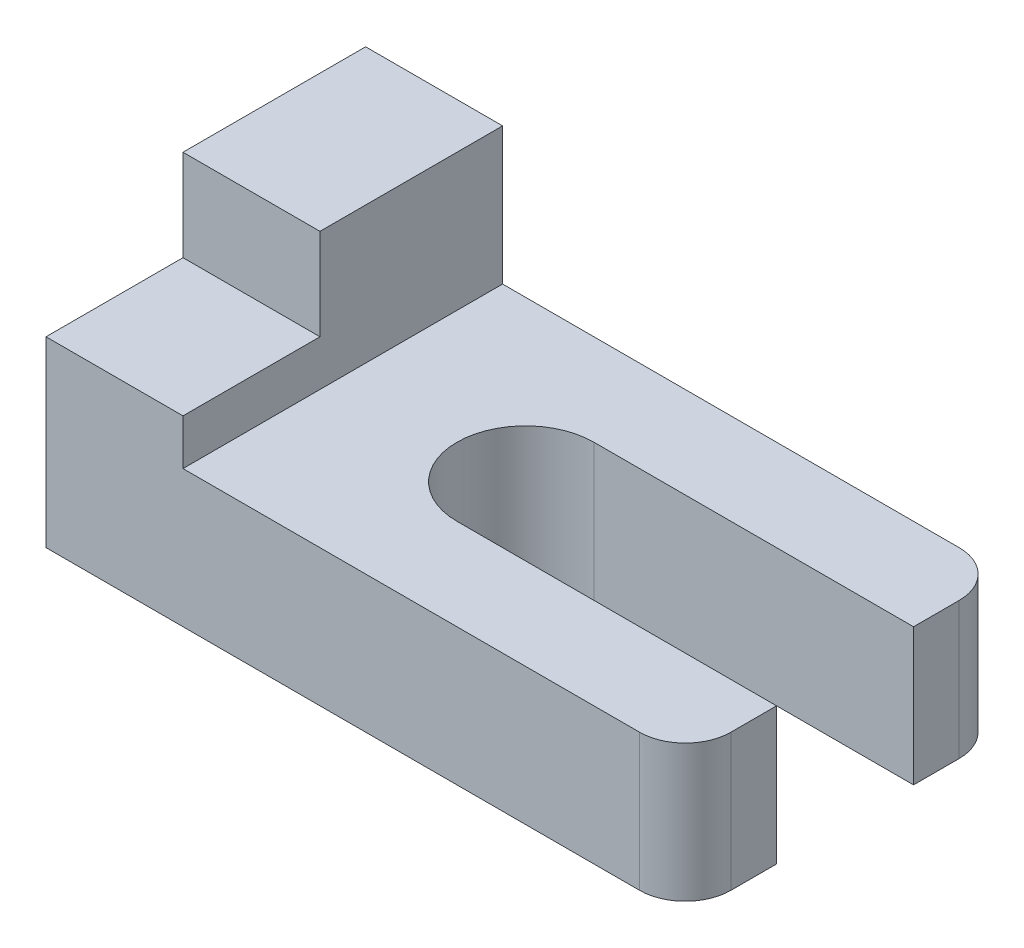
ISO-10303-21;
HEADER;
FILE_DESCRIPTION(('STEP AP214'),'2;1');
FILE_NAME('part.step','',(''),(''),'','','');
FILE_SCHEMA(('AUTOMOTIVE_DESIGN { 1 0 10303 214 1 1 1 1 }'));
ENDSEC;
DATA;
#1=APPLICATION_CONTEXT('core data for automotive mechanical design processes');
#2=APPLICATION_PROTOCOL_DEFINITION('international standard','automotive_design',2000,#1);
#3=PRODUCT_CONTEXT('',#1,'mechanical');
#4=PRODUCT('Part','Part','',(#3));
#5=PRODUCT_RELATED_PRODUCT_CATEGORY('part','',(#4));
#6=PRODUCT_DEFINITION_FORMATION('','',#4);
#7=PRODUCT_DEFINITION_CONTEXT('part definition',#1,'design');
#8=PRODUCT_DEFINITION('design','',#6,#7);
#9=PRODUCT_DEFINITION_SHAPE('','',#8);
#10=(LENGTH_UNIT() NAMED_UNIT(*) SI_UNIT(.MILLI.,.METRE.));
#11=(NAMED_UNIT(*) PLANE_ANGLE_UNIT() SI_UNIT($,.RADIAN.));
#12=(NAMED_UNIT(*) SI_UNIT($,.STERADIAN.) SOLID_ANGLE_UNIT());
#13=UNCERTAINTY_MEASURE_WITH_UNIT(LENGTH_MEASURE(1.E-05),#10,'distance_accuracy_value','');
#14=(GEOMETRIC_REPRESENTATION_CONTEXT(3) GLOBAL_UNCERTAINTY_ASSIGNED_CONTEXT((#13)) GLOBAL_UNIT_ASSIGNED_CONTEXT((#10,
#11,#12)) REPRESENTATION_CONTEXT('',''));
#15=CARTESIAN_POINT('',(0.,0.,0.));
#16=DIRECTION('',(0.,0.,1.));
#17=DIRECTION('',(1.,0.,0.));
#18=AXIS2_PLACEMENT_3D('',#15,#16,#17);
#19=CARTESIAN_POINT('',(70.,30.,0.));
#20=DIRECTION('',(-1.,0.,0.));
#21=DIRECTION('',(0.,0.,1.));
#22=AXIS2_PLACEMENT_3D('',#19,#20,#21);
#23=PLANE('',#22);
#24=DIRECTION('',(0.,0.,-1.));
#25=VECTOR('',#24,1.);
#26=CARTESIAN_POINT('',(70.,0.,0.));
#27=LINE('',#26,#25);
#28=CARTESIAN_POINT('',(70.,0.,-5.));
#29=VERTEX_POINT('',#28);
#30=CARTESIAN_POINT('',(70.,0.,-10.));
#31=VERTEX_POINT('',#30);
#32=EDGE_CURVE('E248',#29,#31,#27,.T.);
#33=ORIENTED_EDGE('',*,*,#32,.T.);
#34=DIRECTION('',(0.,1.,0.));
#35=VECTOR('',#34,1.);
#36=CARTESIAN_POINT('',(70.,0.,-10.));
#37=LINE('',#36,#35);
#38=CARTESIAN_POINT('',(70.,15.,-10.));
#39=VERTEX_POINT('',#38);
#40=EDGE_CURVE('E182',#31,#39,#37,.T.);
#41=ORIENTED_EDGE('',*,*,#40,.T.);
#42=DIRECTION('',(0.,0.,-1.));
#43=VECTOR('',#42,1.);
#44=CARTESIAN_POINT('',(70.,15.,-35.));
#45=LINE('',#44,#43);
#46=CARTESIAN_POINT('',(70.,15.,-5.));
#47=VERTEX_POINT('',#46);
#48=EDGE_CURVE('E166',#47,#39,#45,.T.);
#49=ORIENTED_EDGE('',*,*,#48,.F.);
#50=DIRECTION('',(0.,-1.,0.));
#51=VECTOR('',#50,1.);
#52=CARTESIAN_POINT('',(70.,30.,-5.));
#53=LINE('',#52,#51);
#54=EDGE_CURVE('E271',#47,#29,#53,.T.);
#55=ORIENTED_EDGE('',*,*,#54,.T.);
#56=EDGE_LOOP('',(#33,#41,#49,#55));
#57=FACE_BOUND('',#56,.T.);
#58=ADVANCED_FACE('F39',(#57),#23,.F.);
#59=CARTESIAN_POINT('',(70.,15.,-25.));
#60=VERTEX_POINT('',#59);
#61=CARTESIAN_POINT('',(70.,15.,-30.));
#62=VERTEX_POINT('',#61);
#63=EDGE_CURVE('E215',#60,#62,#45,.T.);
#64=ORIENTED_EDGE('',*,*,#63,.F.);
#65=DIRECTION('',(0.,1.,0.));
#66=VECTOR('',#65,1.);
#67=CARTESIAN_POINT('',(70.,0.,-25.));
#68=LINE('',#67,#66);
#69=CARTESIAN_POINT('',(70.,0.,-25.));
#70=VERTEX_POINT('',#69);
#71=EDGE_CURVE('E55',#70,#60,#68,.T.);
#72=ORIENTED_EDGE('',*,*,#71,.F.);
#73=CARTESIAN_POINT('',(70.,0.,-30.));
#74=VERTEX_POINT('',#73);
#75=EDGE_CURVE('E247',#70,#74,#27,.T.);
#76=ORIENTED_EDGE('',*,*,#75,.T.);
#77=DIRECTION('',(0.,-1.,0.));
#78=VECTOR('',#77,1.);
#79=CARTESIAN_POINT('',(70.,30.,-30.));
#80=LINE('',#79,#78);
#81=EDGE_CURVE('E275',#74,#62,#80,.F.);
#82=ORIENTED_EDGE('',*,*,#81,.T.);
#83=EDGE_LOOP('',(#64,#72,#76,#82));
#84=FACE_BOUND('',#83,.T.);
#85=ADVANCED_FACE('F332',(#84),#23,.F.);
#86=CARTESIAN_POINT('',(0.,30.,0.));
#87=DIRECTION('',(1.,0.,0.));
#88=DIRECTION('',(0.,0.,-1.));
#89=AXIS2_PLACEMENT_3D('',#86,#87,#88);
#90=PLANE('',#89);
#91=DIRECTION('',(0.,0.,1.));
#92=VECTOR('',#91,1.);
#93=CARTESIAN_POINT('',(0.,20.,0.));
#94=LINE('',#93,#92);
#95=CARTESIAN_POINT('',(0.,20.,-15.));
#96=VERTEX_POINT('',#95);
#97=CARTESIAN_POINT('',(0.,20.,0.));
#98=VERTEX_POINT('',#97);
#99=EDGE_CURVE('E185',#96,#98,#94,.T.);
#100=ORIENTED_EDGE('',*,*,#99,.F.);
#101=DIRECTION('',(0.,1.,0.));
#102=VECTOR('',#101,1.);
#103=CARTESIAN_POINT('',(0.,20.,-15.));
#104=LINE('',#103,#102);
#105=CARTESIAN_POINT('',(0.,30.,-15.));
#106=VERTEX_POINT('',#105);
#107=EDGE_CURVE('E201',#96,#106,#104,.T.);
#108=ORIENTED_EDGE('',*,*,#107,.T.);
#109=DIRECTION('',(0.,0.,1.));
#110=VECTOR('',#109,1.);
#111=CARTESIAN_POINT('',(0.,30.,0.));
#112=LINE('',#111,#110);
#113=CARTESIAN_POINT('',(0.,30.,-35.));
#114=VERTEX_POINT('',#113);
#115=EDGE_CURVE('E232',#114,#106,#112,.T.);
#116=ORIENTED_EDGE('',*,*,#115,.F.);
#117=DIRECTION('',(0.,-1.,0.));
#118=VECTOR('',#117,1.);
#119=CARTESIAN_POINT('',(0.,30.,-35.));
#120=LINE('',#119,#118);
#121=CARTESIAN_POINT('',(0.,0.,-35.));
#122=VERTEX_POINT('',#121);
#123=EDGE_CURVE('E240',#114,#122,#120,.T.);
#124=ORIENTED_EDGE('',*,*,#123,.T.);
#125=DIRECTION('',(0.,0.,1.));
#126=VECTOR('',#125,1.);
#127=CARTESIAN_POINT('',(0.,0.,0.));
#128=LINE('',#127,#126);
#129=CARTESIAN_POINT('',(0.,0.,0.));
#130=VERTEX_POINT('',#129);
#131=EDGE_CURVE('E228',#122,#130,#128,.T.);
#132=ORIENTED_EDGE('',*,*,#131,.T.);
#133=DIRECTION('',(0.,-1.,0.));
#134=VECTOR('',#133,1.);
#135=CARTESIAN_POINT('',(0.,30.,0.));
#136=LINE('',#135,#134);
#137=EDGE_CURVE('E257',#98,#130,#136,.T.);
#138=ORIENTED_EDGE('',*,*,#137,.F.);
#139=EDGE_LOOP('',(#100,#108,#116,#124,#132,#138));
#140=FACE_BOUND('',#139,.T.);
#141=ADVANCED_FACE('F305',(#140),#90,.F.);
#142=CARTESIAN_POINT('',(0.,30.,0.));
#143=DIRECTION('',(0.,0.,-1.));
#144=DIRECTION('',(-1.,0.,0.));
#145=AXIS2_PLACEMENT_3D('',#142,#143,#144);
#146=PLANE('',#145);
#147=DIRECTION('',(1.,0.,0.));
#148=VECTOR('',#147,1.);
#149=CARTESIAN_POINT('',(0.,0.,0.));
#150=LINE('',#149,#148);
#151=CARTESIAN_POINT('',(65.,0.,0.));
#152=VERTEX_POINT('',#151);
#153=EDGE_CURVE('E244',#130,#152,#150,.T.);
#154=ORIENTED_EDGE('',*,*,#153,.T.);
#155=DIRECTION('',(0.,-1.,0.));
#156=VECTOR('',#155,1.);
#157=CARTESIAN_POINT('',(65.,30.,0.));
#158=LINE('',#157,#156);
#159=CARTESIAN_POINT('',(65.,15.,0.));
#160=VERTEX_POINT('',#159);
#161=EDGE_CURVE('E11',#152,#160,#158,.F.);
#162=ORIENTED_EDGE('',*,*,#161,.T.);
#163=DIRECTION('',(1.,0.,0.));
#164=VECTOR('',#163,1.);
#165=CARTESIAN_POINT('',(15.,15.,0.));
#166=LINE('',#165,#164);
#167=CARTESIAN_POINT('',(15.,15.,0.));
#168=VERTEX_POINT('',#167);
#169=EDGE_CURVE('E212',#168,#160,#166,.T.);
#170=ORIENTED_EDGE('',*,*,#169,.F.);
#171=DIRECTION('',(0.,1.,0.));
#172=VECTOR('',#171,1.);
#173=CARTESIAN_POINT('',(15.,15.,0.));
#174=LINE('',#173,#172);
#175=CARTESIAN_POINT('',(15.,20.,0.));
#176=VERTEX_POINT('',#175);
#177=EDGE_CURVE('E221',#168,#176,#174,.T.);
#178=ORIENTED_EDGE('',*,*,#177,.T.);
#179=DIRECTION('',(1.,0.,0.));
#180=VECTOR('',#179,1.);
#181=CARTESIAN_POINT('',(0.,20.,0.));
#182=LINE('',#181,#180);
#183=EDGE_CURVE('E188',#98,#176,#182,.T.);
#184=ORIENTED_EDGE('',*,*,#183,.F.);
#185=ORIENTED_EDGE('',*,*,#137,.T.);
#186=EDGE_LOOP('',(#154,#162,#170,#178,#184,#185));
#187=FACE_BOUND('',#186,.T.);
#188=ADVANCED_FACE('F316',(#187),#146,.F.);
#189=CARTESIAN_POINT('',(0.,30.,-35.));
#190=DIRECTION('',(0.,0.,1.));
#191=DIRECTION('',(1.,0.,0.));
#192=AXIS2_PLACEMENT_3D('',#189,#190,#191);
#193=PLANE('',#192);
#194=DIRECTION('',(-1.,0.,0.));
#195=VECTOR('',#194,1.);
#196=CARTESIAN_POINT('',(15.,15.,-35.));
#197=LINE('',#196,#195);
#198=CARTESIAN_POINT('',(65.,15.,-35.));
#199=VERTEX_POINT('',#198);
#200=CARTESIAN_POINT('',(15.,15.,-35.));
#201=VERTEX_POINT('',#200);
#202=EDGE_CURVE('E218',#199,#201,#197,.T.);
#203=ORIENTED_EDGE('',*,*,#202,.F.);
#204=DIRECTION('',(0.,-1.,0.));
#205=VECTOR('',#204,1.);
#206=CARTESIAN_POINT('',(65.,30.,-35.));
#207=LINE('',#206,#205);
#208=CARTESIAN_POINT('',(65.,0.,-35.));
#209=VERTEX_POINT('',#208);
#210=EDGE_CURVE('E260',#199,#209,#207,.T.);
#211=ORIENTED_EDGE('',*,*,#210,.T.);
#212=DIRECTION('',(-1.,0.,0.));
#213=VECTOR('',#212,1.);
#214=CARTESIAN_POINT('',(0.,0.,-35.));
#215=LINE('',#214,#213);
#216=EDGE_CURVE('E237',#209,#122,#215,.T.);
#217=ORIENTED_EDGE('',*,*,#216,.T.);
#218=ORIENTED_EDGE('',*,*,#123,.F.);
#219=DIRECTION('',(-1.,0.,0.));
#220=VECTOR('',#219,1.);
#221=CARTESIAN_POINT('',(0.,30.,-35.));
#222=LINE('',#221,#220);
#223=CARTESIAN_POINT('',(15.,30.,-35.));
#224=VERTEX_POINT('',#223);
#225=EDGE_CURVE('E236',#224,#114,#222,.T.);
#226=ORIENTED_EDGE('',*,*,#225,.F.);
#227=DIRECTION('',(0.,1.,0.));
#228=VECTOR('',#227,1.);
#229=CARTESIAN_POINT('',(15.,15.,-35.));
#230=LINE('',#229,#228);
#231=EDGE_CURVE('E225',#201,#224,#230,.T.);
#232=ORIENTED_EDGE('',*,*,#231,.F.);
#233=EDGE_LOOP('',(#203,#211,#217,#218,#226,#232));
#234=FACE_BOUND('',#233,.T.);
#235=ADVANCED_FACE('F291',(#234),#193,.F.);
#236=CARTESIAN_POINT('',(0.,30.,0.));
#237=DIRECTION('',(0.,-1.,0.));
#238=DIRECTION('',(0.,0.,-1.));
#239=AXIS2_PLACEMENT_3D('',#236,#237,#238);
#240=PLANE('',#239);
#241=ORIENTED_EDGE('',*,*,#115,.T.);
#242=DIRECTION('',(-1.,0.,0.));
#243=VECTOR('',#242,1.);
#244=CARTESIAN_POINT('',(0.,30.,-15.));
#245=LINE('',#244,#243);
#246=CARTESIAN_POINT('',(15.,30.,-15.));
#247=VERTEX_POINT('',#246);
#248=EDGE_CURVE('E161',#247,#106,#245,.T.);
#249=ORIENTED_EDGE('',*,*,#248,.F.);
#250=DIRECTION('',(0.,0.,1.));
#251=VECTOR('',#250,1.);
#252=CARTESIAN_POINT('',(15.,30.,-35.));
#253=LINE('',#252,#251);
#254=EDGE_CURVE('E205',#224,#247,#253,.T.);
#255=ORIENTED_EDGE('',*,*,#254,.F.);
#256=ORIENTED_EDGE('',*,*,#225,.T.);
#257=EDGE_LOOP('',(#241,#249,#255,#256));
#258=FACE_BOUND('',#257,.T.);
#259=ADVANCED_FACE('F309',(#258),#240,.F.);
#260=CARTESIAN_POINT('',(0.,0.,0.));
#261=DIRECTION('',(0.,-1.,0.));
#262=DIRECTION('',(0.,0.,-1.));
#263=AXIS2_PLACEMENT_3D('',#260,#261,#262);
#264=PLANE('',#263);
#265=CARTESIAN_POINT('',(35.,0.,-17.5));
#266=DIRECTION('',(0.,1.,0.));
#267=DIRECTION('',(0.,0.,1.));
#268=AXIS2_PLACEMENT_3D('',#265,#266,#267);
#269=CIRCLE('',#268,7.5);
#270=CARTESIAN_POINT('',(35.,0.,-25.));
#271=VERTEX_POINT('',#270);
#272=CARTESIAN_POINT('',(35.,0.,-10.));
#273=VERTEX_POINT('',#272);
#274=EDGE_CURVE('E151',#271,#273,#269,.T.);
#275=ORIENTED_EDGE('',*,*,#274,.T.);
#276=DIRECTION('',(1.,0.,0.));
#277=VECTOR('',#276,1.);
#278=CARTESIAN_POINT('',(70.,0.,-10.));
#279=LINE('',#278,#277);
#280=EDGE_CURVE('E159',#273,#31,#279,.T.);
#281=ORIENTED_EDGE('',*,*,#280,.T.);
#282=ORIENTED_EDGE('',*,*,#32,.F.);
#283=CARTESIAN_POINT('',(65.,0.,-5.));
#284=DIRECTION('',(0.,-1.,0.));
#285=DIRECTION('',(0.,0.,-1.));
#286=AXIS2_PLACEMENT_3D('',#283,#284,#285);
#287=CIRCLE('',#286,5.);
#288=EDGE_CURVE('E264',#29,#152,#287,.T.);
#289=ORIENTED_EDGE('',*,*,#288,.T.);
#290=ORIENTED_EDGE('',*,*,#153,.F.);
#291=ORIENTED_EDGE('',*,*,#131,.F.);
#292=ORIENTED_EDGE('',*,*,#216,.F.);
#293=CARTESIAN_POINT('',(65.,0.,-30.));
#294=DIRECTION('',(0.,-1.,0.));
#295=DIRECTION('',(0.,0.,-1.));
#296=AXIS2_PLACEMENT_3D('',#293,#294,#295);
#297=CIRCLE('',#296,5.);
#298=EDGE_CURVE('E267',#209,#74,#297,.T.);
#299=ORIENTED_EDGE('',*,*,#298,.T.);
#300=ORIENTED_EDGE('',*,*,#75,.F.);
#301=DIRECTION('',(-1.,0.,0.));
#302=VECTOR('',#301,1.);
#303=CARTESIAN_POINT('',(70.,0.,-25.));
#304=LINE('',#303,#302);
#305=EDGE_CURVE('E175',#70,#271,#304,.T.);
#306=ORIENTED_EDGE('',*,*,#305,.T.);
#307=EDGE_LOOP('',(#275,#281,#282,#289,#290,#291,#292,#299,#300,#306));
#308=FACE_BOUND('',#307,.T.);
#309=ADVANCED_FACE('F297',(#308),#264,.T.);
#310=CARTESIAN_POINT('',(15.,15.,-35.));
#311=DIRECTION('',(-1.,0.,0.));
#312=DIRECTION('',(0.,0.,1.));
#313=AXIS2_PLACEMENT_3D('',#310,#311,#312);
#314=PLANE('',#313);
#315=ORIENTED_EDGE('',*,*,#254,.T.);
#316=DIRECTION('',(0.,1.,0.));
#317=VECTOR('',#316,1.);
#318=CARTESIAN_POINT('',(15.,20.,-15.));
#319=LINE('',#318,#317);
#320=CARTESIAN_POINT('',(15.,20.,-15.));
#321=VERTEX_POINT('',#320);
#322=EDGE_CURVE('E198',#321,#247,#319,.T.);
#323=ORIENTED_EDGE('',*,*,#322,.F.);
#324=DIRECTION('',(0.,0.,-1.));
#325=VECTOR('',#324,1.);
#326=CARTESIAN_POINT('',(15.,20.,0.));
#327=LINE('',#326,#325);
#328=EDGE_CURVE('E191',#176,#321,#327,.T.);
#329=ORIENTED_EDGE('',*,*,#328,.F.);
#330=ORIENTED_EDGE('',*,*,#177,.F.);
#331=DIRECTION('',(0.,0.,1.));
#332=VECTOR('',#331,1.);
#333=CARTESIAN_POINT('',(15.,15.,-35.));
#334=LINE('',#333,#332);
#335=EDGE_CURVE('E208',#201,#168,#334,.T.);
#336=ORIENTED_EDGE('',*,*,#335,.F.);
#337=ORIENTED_EDGE('',*,*,#231,.T.);
#338=EDGE_LOOP('',(#315,#323,#329,#330,#336,#337));
#339=FACE_BOUND('',#338,.T.);
#340=ADVANCED_FACE('F313',(#339),#314,.F.);
#341=CARTESIAN_POINT('',(0.,15.,0.));
#342=DIRECTION('',(0.,1.,0.));
#343=DIRECTION('',(0.,0.,1.));
#344=AXIS2_PLACEMENT_3D('',#341,#342,#343);
#345=PLANE('',#344);
#346=CARTESIAN_POINT('',(35.,15.,-17.5));
#347=DIRECTION('',(0.,1.,0.));
#348=DIRECTION('',(0.,0.,1.));
#349=AXIS2_PLACEMENT_3D('',#346,#347,#348);
#350=CIRCLE('',#349,7.5);
#351=CARTESIAN_POINT('',(35.,15.,-25.));
#352=VERTEX_POINT('',#351);
#353=CARTESIAN_POINT('',(35.,15.,-10.));
#354=VERTEX_POINT('',#353);
#355=EDGE_CURVE('E141',#352,#354,#350,.T.);
#356=ORIENTED_EDGE('',*,*,#355,.F.);
#357=DIRECTION('',(-1.,0.,0.));
#358=VECTOR('',#357,1.);
#359=CARTESIAN_POINT('',(70.,15.,-25.));
#360=LINE('',#359,#358);
#361=EDGE_CURVE('E168',#60,#352,#360,.T.);
#362=ORIENTED_EDGE('',*,*,#361,.F.);
#363=ORIENTED_EDGE('',*,*,#63,.T.);
#364=CARTESIAN_POINT('',(65.,15.,-30.));
#365=DIRECTION('',(0.,1.,0.));
#366=DIRECTION('',(0.,0.,1.));
#367=AXIS2_PLACEMENT_3D('',#364,#365,#366);
#368=CIRCLE('',#367,5.);
#369=EDGE_CURVE('E48',#62,#199,#368,.T.);
#370=ORIENTED_EDGE('',*,*,#369,.T.);
#371=ORIENTED_EDGE('',*,*,#202,.T.);
#372=ORIENTED_EDGE('',*,*,#335,.T.);
#373=ORIENTED_EDGE('',*,*,#169,.T.);
#374=CARTESIAN_POINT('',(65.,15.,-5.));
#375=DIRECTION('',(0.,1.,0.));
#376=DIRECTION('',(0.,0.,1.));
#377=AXIS2_PLACEMENT_3D('',#374,#375,#376);
#378=CIRCLE('',#377,5.);
#379=EDGE_CURVE('E279',#160,#47,#378,.T.);
#380=ORIENTED_EDGE('',*,*,#379,.T.);
#381=ORIENTED_EDGE('',*,*,#48,.T.);
#382=DIRECTION('',(1.,0.,0.));
#383=VECTOR('',#382,1.);
#384=CARTESIAN_POINT('',(70.,15.,-10.));
#385=LINE('',#384,#383);
#386=EDGE_CURVE('E156',#354,#39,#385,.T.);
#387=ORIENTED_EDGE('',*,*,#386,.F.);
#388=EDGE_LOOP('',(#356,#362,#363,#370,#371,#372,#373,#380,#381,#387));
#389=FACE_BOUND('',#388,.T.);
#390=ADVANCED_FACE('F164',(#389),#345,.T.);
#391=CARTESIAN_POINT('',(0.,20.,-15.));
#392=DIRECTION('',(0.,0.,-1.));
#393=DIRECTION('',(-1.,0.,0.));
#394=AXIS2_PLACEMENT_3D('',#391,#392,#393);
#395=PLANE('',#394);
#396=ORIENTED_EDGE('',*,*,#248,.T.);
#397=ORIENTED_EDGE('',*,*,#107,.F.);
#398=DIRECTION('',(-1.,0.,0.));
#399=VECTOR('',#398,1.);
#400=CARTESIAN_POINT('',(0.,20.,-15.));
#401=LINE('',#400,#399);
#402=EDGE_CURVE('E194',#321,#96,#401,.T.);
#403=ORIENTED_EDGE('',*,*,#402,.F.);
#404=ORIENTED_EDGE('',*,*,#322,.T.);
#405=EDGE_LOOP('',(#396,#397,#403,#404));
#406=FACE_BOUND('',#405,.T.);
#407=ADVANCED_FACE('F322',(#406),#395,.F.);
#408=CARTESIAN_POINT('',(0.,20.,0.));
#409=DIRECTION('',(0.,-1.,0.));
#410=DIRECTION('',(0.,0.,-1.));
#411=AXIS2_PLACEMENT_3D('',#408,#409,#410);
#412=PLANE('',#411);
#413=ORIENTED_EDGE('',*,*,#99,.T.);
#414=ORIENTED_EDGE('',*,*,#183,.T.);
#415=ORIENTED_EDGE('',*,*,#328,.T.);
#416=ORIENTED_EDGE('',*,*,#402,.T.);
#417=EDGE_LOOP('',(#413,#414,#415,#416));
#418=FACE_BOUND('',#417,.T.);
#419=ADVANCED_FACE('F319',(#418),#412,.F.);
#420=CARTESIAN_POINT('',(65.,30.,-30.));
#421=DIRECTION('',(0.,-1.,0.));
#422=DIRECTION('',(0.,0.,-1.));
#423=AXIS2_PLACEMENT_3D('',#420,#421,#422);
#424=CYLINDRICAL_SURFACE('',#423,5.);
#425=ORIENTED_EDGE('',*,*,#369,.F.);
#426=ORIENTED_EDGE('',*,*,#81,.F.);
#427=ORIENTED_EDGE('',*,*,#298,.F.);
#428=ORIENTED_EDGE('',*,*,#210,.F.);
#429=EDGE_LOOP('',(#425,#426,#427,#428));
#430=FACE_BOUND('',#429,.T.);
#431=ADVANCED_FACE('F294',(#430),#424,.T.);
#432=CARTESIAN_POINT('',(65.,30.,-5.));
#433=DIRECTION('',(0.,-1.,0.));
#434=DIRECTION('',(0.,0.,-1.));
#435=AXIS2_PLACEMENT_3D('',#432,#433,#434);
#436=CYLINDRICAL_SURFACE('',#435,5.);
#437=ORIENTED_EDGE('',*,*,#379,.F.);
#438=ORIENTED_EDGE('',*,*,#161,.F.);
#439=ORIENTED_EDGE('',*,*,#288,.F.);
#440=ORIENTED_EDGE('',*,*,#54,.F.);
#441=EDGE_LOOP('',(#437,#438,#439,#440));
#442=FACE_BOUND('',#441,.T.);
#443=ADVANCED_FACE('F41',(#442),#436,.T.);
#444=CARTESIAN_POINT('',(70.,0.,-10.));
#445=DIRECTION('',(0.,0.,1.));
#446=DIRECTION('',(1.,0.,0.));
#447=AXIS2_PLACEMENT_3D('',#444,#445,#446);
#448=PLANE('',#447);
#449=ORIENTED_EDGE('',*,*,#386,.T.);
#450=ORIENTED_EDGE('',*,*,#40,.F.);
#451=ORIENTED_EDGE('',*,*,#280,.F.);
#452=DIRECTION('',(0.,1.,0.));
#453=VECTOR('',#452,1.);
#454=CARTESIAN_POINT('',(35.,0.,-10.));
#455=LINE('',#454,#453);
#456=EDGE_CURVE('E144',#273,#354,#455,.T.);
#457=ORIENTED_EDGE('',*,*,#456,.T.);
#458=EDGE_LOOP('',(#449,#450,#451,#457));
#459=FACE_BOUND('',#458,.T.);
#460=ADVANCED_FACE('F155',(#459),#448,.F.);
#461=CARTESIAN_POINT('',(70.,0.,-25.));
#462=DIRECTION('',(0.,0.,-1.));
#463=DIRECTION('',(-1.,0.,0.));
#464=AXIS2_PLACEMENT_3D('',#461,#462,#463);
#465=PLANE('',#464);
#466=ORIENTED_EDGE('',*,*,#361,.T.);
#467=DIRECTION('',(0.,1.,0.));
#468=VECTOR('',#467,1.);
#469=CARTESIAN_POINT('',(35.,0.,-25.));
#470=LINE('',#469,#468);
#471=EDGE_CURVE('E147',#271,#352,#470,.T.);
#472=ORIENTED_EDGE('',*,*,#471,.F.);
#473=ORIENTED_EDGE('',*,*,#305,.F.);
#474=ORIENTED_EDGE('',*,*,#71,.T.);
#475=EDGE_LOOP('',(#466,#472,#473,#474));
#476=FACE_BOUND('',#475,.T.);
#477=ADVANCED_FACE('F353',(#476),#465,.F.);
#478=CARTESIAN_POINT('',(35.,0.,-17.5));
#479=DIRECTION('',(0.,1.,0.));
#480=DIRECTION('',(0.,0.,1.));
#481=AXIS2_PLACEMENT_3D('',#478,#479,#480);
#482=CYLINDRICAL_SURFACE('',#481,7.5);
#483=ORIENTED_EDGE('',*,*,#274,.F.);
#484=ORIENTED_EDGE('',*,*,#471,.T.);
#485=ORIENTED_EDGE('',*,*,#355,.T.);
#486=ORIENTED_EDGE('',*,*,#456,.F.);
#487=EDGE_LOOP('',(#483,#484,#485,#486));
#488=FACE_BOUND('',#487,.T.);
#489=ADVANCED_FACE('F143',(#488),#482,.F.);
#490=CLOSED_SHELL('',(#58,#85,#141,#188,#235,#259,#309,#340,#390,#407,#419,#431,#443,#460,#477,#489));
#491=MANIFOLD_SOLID_BREP('B2',#490);
#492=ADVANCED_BREP_SHAPE_REPRESENTATION('',(#18,#491),#14);
#493=SHAPE_DEFINITION_REPRESENTATION(#9,#492);
ENDSEC;
END-ISO-10303-21;
